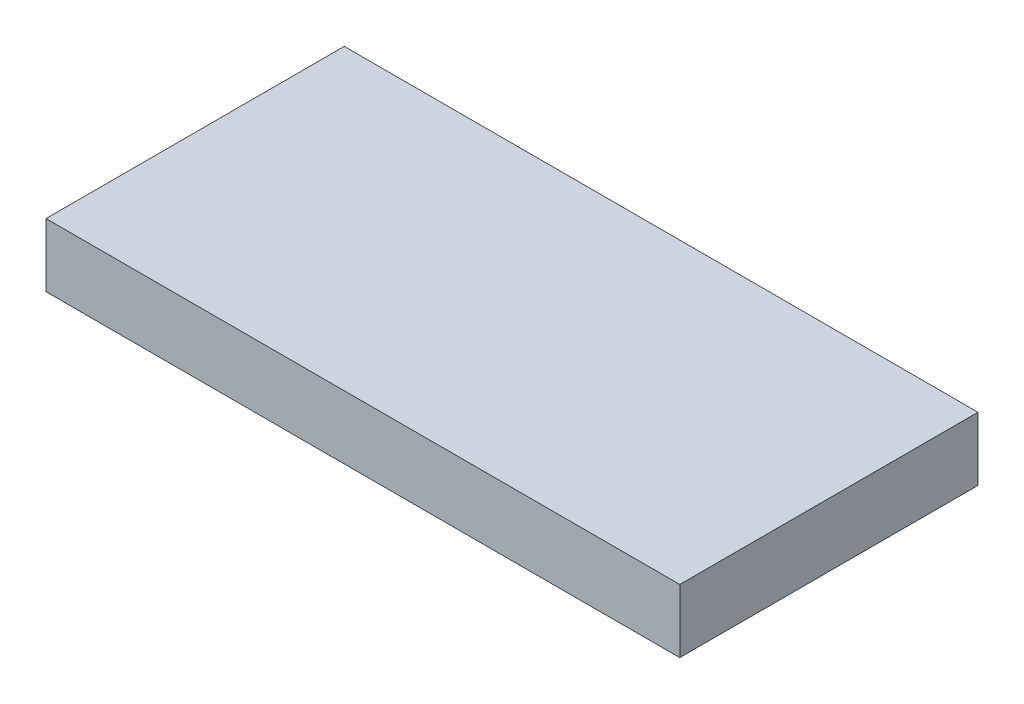
ISO-10303-21;
HEADER;
FILE_DESCRIPTION(('STEP AP214'),'2;1');
FILE_NAME('part.step','',(''),(''),'','','');
FILE_SCHEMA(('AUTOMOTIVE_DESIGN { 1 0 10303 214 1 1 1 1 }'));
ENDSEC;
DATA;
#1=APPLICATION_CONTEXT('core data for automotive mechanical design processes');
#2=APPLICATION_PROTOCOL_DEFINITION('international standard','automotive_design',2000,#1);
#3=PRODUCT_CONTEXT('',#1,'mechanical');
#4=PRODUCT('Part','Part','',(#3));
#5=PRODUCT_RELATED_PRODUCT_CATEGORY('part','',(#4));
#6=PRODUCT_DEFINITION_FORMATION('','',#4);
#7=PRODUCT_DEFINITION_CONTEXT('part definition',#1,'design');
#8=PRODUCT_DEFINITION('design','',#6,#7);
#9=PRODUCT_DEFINITION_SHAPE('','',#8);
#10=(LENGTH_UNIT() NAMED_UNIT(*) SI_UNIT(.MILLI.,.METRE.));
#11=(NAMED_UNIT(*) PLANE_ANGLE_UNIT() SI_UNIT($,.RADIAN.));
#12=(NAMED_UNIT(*) SI_UNIT($,.STERADIAN.) SOLID_ANGLE_UNIT());
#13=UNCERTAINTY_MEASURE_WITH_UNIT(LENGTH_MEASURE(1.E-05),#10,'distance_accuracy_value','');
#14=(GEOMETRIC_REPRESENTATION_CONTEXT(3) GLOBAL_UNCERTAINTY_ASSIGNED_CONTEXT((#13)) GLOBAL_UNIT_ASSIGNED_CONTEXT((#10,
#11,#12)) REPRESENTATION_CONTEXT('',''));
#15=CARTESIAN_POINT('',(0.,0.,0.));
#16=DIRECTION('',(0.,0.,1.));
#17=DIRECTION('',(1.,0.,0.));
#18=AXIS2_PLACEMENT_3D('',#15,#16,#17);
#19=CARTESIAN_POINT('',(-24.5618839059766,1.7,7.97520904453767));
#20=DIRECTION('',(1.,0.,0.));
#21=DIRECTION('',(0.,0.,-1.));
#22=AXIS2_PLACEMENT_3D('',#19,#20,#21);
#23=PLANE('',#22);
#24=DIRECTION('',(0.,0.,1.));
#25=VECTOR('',#24,1.);
#26=CARTESIAN_POINT('',(-24.5618839059766,0.,7.97520904453767));
#27=LINE('',#26,#25);
#28=CARTESIAN_POINT('',(-24.5618839059766,0.,7.97520904453767));
#29=VERTEX_POINT('',#28);
#30=CARTESIAN_POINT('',(-24.5618839059766,0.,15.9752090445377));
#31=VERTEX_POINT('',#30);
#32=EDGE_CURVE('E96',#29,#31,#27,.T.);
#33=ORIENTED_EDGE('',*,*,#32,.T.);
#34=DIRECTION('',(0.,-1.,0.));
#35=VECTOR('',#34,1.);
#36=CARTESIAN_POINT('',(-24.5618839059766,1.7,15.9752090445377));
#37=LINE('',#36,#35);
#38=CARTESIAN_POINT('',(-24.5618839059766,1.7,15.9752090445377));
#39=VERTEX_POINT('',#38);
#40=EDGE_CURVE('E11',#39,#31,#37,.T.);
#41=ORIENTED_EDGE('',*,*,#40,.F.);
#42=DIRECTION('',(0.,0.,1.));
#43=VECTOR('',#42,1.);
#44=CARTESIAN_POINT('',(-24.5618839059766,1.7,7.97520904453767));
#45=LINE('',#44,#43);
#46=CARTESIAN_POINT('',(-24.5618839059766,1.7,7.97520904453767));
#47=VERTEX_POINT('',#46);
#48=EDGE_CURVE('E84',#47,#39,#45,.T.);
#49=ORIENTED_EDGE('',*,*,#48,.F.);
#50=DIRECTION('',(0.,-1.,0.));
#51=VECTOR('',#50,1.);
#52=CARTESIAN_POINT('',(-24.5618839059766,1.7,7.97520904453767));
#53=LINE('',#52,#51);
#54=EDGE_CURVE('E92',#47,#29,#53,.T.);
#55=ORIENTED_EDGE('',*,*,#54,.T.);
#56=EDGE_LOOP('',(#33,#41,#49,#55));
#57=FACE_BOUND('',#56,.T.);
#58=ADVANCED_FACE('F33',(#57),#23,.F.);
#59=CARTESIAN_POINT('',(-24.5618839059766,1.7,15.9752090445377));
#60=DIRECTION('',(0.,0.,-1.));
#61=DIRECTION('',(-1.,0.,0.));
#62=AXIS2_PLACEMENT_3D('',#59,#60,#61);
#63=PLANE('',#62);
#64=DIRECTION('',(1.,0.,0.));
#65=VECTOR('',#64,1.);
#66=CARTESIAN_POINT('',(-24.5618839059766,0.,15.9752090445377));
#67=LINE('',#66,#65);
#68=CARTESIAN_POINT('',(-7.56188390597663,0.,15.9752090445377));
#69=VERTEX_POINT('',#68);
#70=EDGE_CURVE('E88',#31,#69,#67,.T.);
#71=ORIENTED_EDGE('',*,*,#70,.T.);
#72=DIRECTION('',(0.,-1.,0.));
#73=VECTOR('',#72,1.);
#74=CARTESIAN_POINT('',(-7.56188390597663,1.7,15.9752090445377));
#75=LINE('',#74,#73);
#76=CARTESIAN_POINT('',(-7.56188390597663,1.7,15.9752090445377));
#77=VERTEX_POINT('',#76);
#78=EDGE_CURVE('E41',#77,#69,#75,.T.);
#79=ORIENTED_EDGE('',*,*,#78,.F.);
#80=DIRECTION('',(1.,0.,0.));
#81=VECTOR('',#80,1.);
#82=CARTESIAN_POINT('',(-24.5618839059766,1.7,15.9752090445377));
#83=LINE('',#82,#81);
#84=EDGE_CURVE('E79',#39,#77,#83,.T.);
#85=ORIENTED_EDGE('',*,*,#84,.F.);
#86=ORIENTED_EDGE('',*,*,#40,.T.);
#87=EDGE_LOOP('',(#71,#79,#85,#86));
#88=FACE_BOUND('',#87,.T.);
#89=ADVANCED_FACE('F87',(#88),#63,.F.);
#90=CARTESIAN_POINT('',(-7.56188390597663,1.7,7.97520904453767));
#91=DIRECTION('',(-1.,0.,0.));
#92=DIRECTION('',(0.,0.,1.));
#93=AXIS2_PLACEMENT_3D('',#90,#91,#92);
#94=PLANE('',#93);
#95=DIRECTION('',(0.,0.,-1.));
#96=VECTOR('',#95,1.);
#97=CARTESIAN_POINT('',(-7.56188390597663,0.,7.97520904453767));
#98=LINE('',#97,#96);
#99=CARTESIAN_POINT('',(-7.56188390597663,0.,7.97520904453767));
#100=VERTEX_POINT('',#99);
#101=EDGE_CURVE('E66',#69,#100,#98,.T.);
#102=ORIENTED_EDGE('',*,*,#101,.T.);
#103=DIRECTION('',(0.,-1.,0.));
#104=VECTOR('',#103,1.);
#105=CARTESIAN_POINT('',(-7.56188390597663,1.7,7.97520904453767));
#106=LINE('',#105,#104);
#107=CARTESIAN_POINT('',(-7.56188390597663,1.7,7.97520904453767));
#108=VERTEX_POINT('',#107);
#109=EDGE_CURVE('E89',#108,#100,#106,.T.);
#110=ORIENTED_EDGE('',*,*,#109,.F.);
#111=DIRECTION('',(0.,0.,-1.));
#112=VECTOR('',#111,1.);
#113=CARTESIAN_POINT('',(-7.56188390597663,1.7,7.97520904453767));
#114=LINE('',#113,#112);
#115=EDGE_CURVE('E82',#77,#108,#114,.T.);
#116=ORIENTED_EDGE('',*,*,#115,.F.);
#117=ORIENTED_EDGE('',*,*,#78,.T.);
#118=EDGE_LOOP('',(#102,#110,#116,#117));
#119=FACE_BOUND('',#118,.T.);
#120=ADVANCED_FACE('F90',(#119),#94,.F.);
#121=CARTESIAN_POINT('',(-24.5618839059766,1.7,7.97520904453767));
#122=DIRECTION('',(0.,0.,1.));
#123=DIRECTION('',(1.,0.,0.));
#124=AXIS2_PLACEMENT_3D('',#121,#122,#123);
#125=PLANE('',#124);
#126=DIRECTION('',(-1.,0.,0.));
#127=VECTOR('',#126,1.);
#128=CARTESIAN_POINT('',(-24.5618839059766,0.,7.97520904453767));
#129=LINE('',#128,#127);
#130=EDGE_CURVE('E72',#100,#29,#129,.T.);
#131=ORIENTED_EDGE('',*,*,#130,.T.);
#132=ORIENTED_EDGE('',*,*,#54,.F.);
#133=DIRECTION('',(-1.,0.,0.));
#134=VECTOR('',#133,1.);
#135=CARTESIAN_POINT('',(-24.5618839059766,1.7,7.97520904453767));
#136=LINE('',#135,#134);
#137=EDGE_CURVE('E49',#108,#47,#136,.T.);
#138=ORIENTED_EDGE('',*,*,#137,.F.);
#139=ORIENTED_EDGE('',*,*,#109,.T.);
#140=EDGE_LOOP('',(#131,#132,#138,#139));
#141=FACE_BOUND('',#140,.T.);
#142=ADVANCED_FACE('F103',(#141),#125,.F.);
#143=CARTESIAN_POINT('',(0.,1.7,0.));
#144=DIRECTION('',(0.,1.,0.));
#145=DIRECTION('',(0.,0.,1.));
#146=AXIS2_PLACEMENT_3D('',#143,#144,#145);
#147=PLANE('',#146);
#148=ORIENTED_EDGE('',*,*,#48,.T.);
#149=ORIENTED_EDGE('',*,*,#84,.T.);
#150=ORIENTED_EDGE('',*,*,#115,.T.);
#151=ORIENTED_EDGE('',*,*,#137,.T.);
#152=EDGE_LOOP('',(#148,#149,#150,#151));
#153=FACE_BOUND('',#152,.T.);
#154=ADVANCED_FACE('F80',(#153),#147,.T.);
#155=CARTESIAN_POINT('',(0.,0.,0.));
#156=DIRECTION('',(0.,1.,0.));
#157=DIRECTION('',(0.,0.,1.));
#158=AXIS2_PLACEMENT_3D('',#155,#156,#157);
#159=PLANE('',#158);
#160=ORIENTED_EDGE('',*,*,#32,.F.);
#161=ORIENTED_EDGE('',*,*,#130,.F.);
#162=ORIENTED_EDGE('',*,*,#101,.F.);
#163=ORIENTED_EDGE('',*,*,#70,.F.);
#164=EDGE_LOOP('',(#160,#161,#162,#163));
#165=FACE_BOUND('',#164,.T.);
#166=ADVANCED_FACE('F106',(#165),#159,.F.);
#167=CLOSED_SHELL('',(#58,#89,#120,#142,#154,#166));
#168=MANIFOLD_SOLID_BREP('B2',#167);
#169=ADVANCED_BREP_SHAPE_REPRESENTATION('',(#18,#168),#14);
#170=SHAPE_DEFINITION_REPRESENTATION(#9,#169);
ENDSEC;
END-ISO-10303-21;
